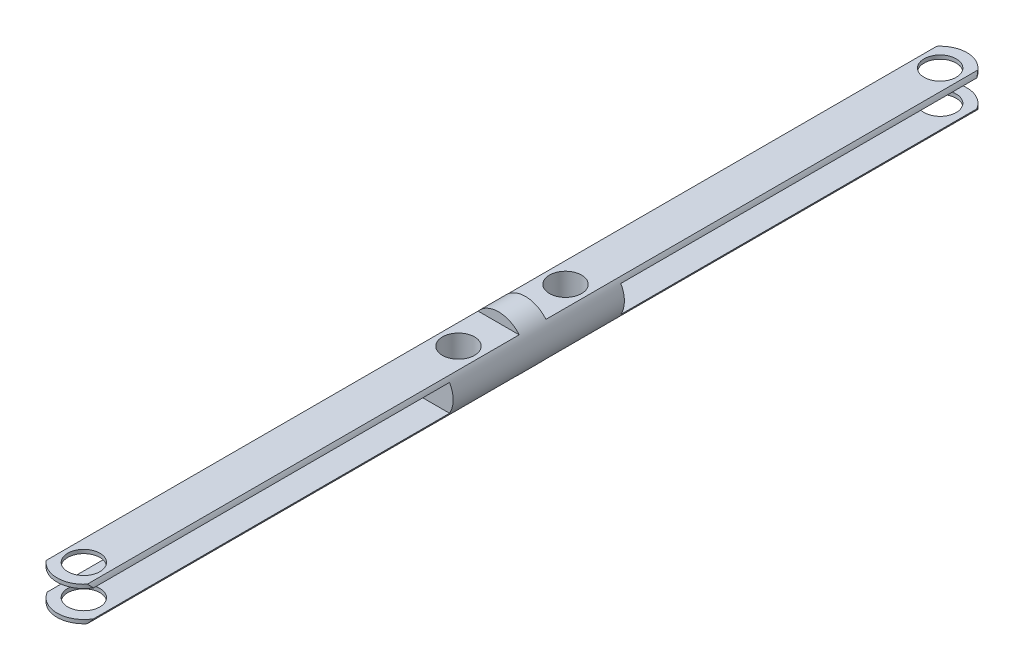
ISO-10303-21;
HEADER;
FILE_DESCRIPTION(('STEP AP214'),'2;1');
FILE_NAME('part.step','',(''),(''),'','','');
FILE_SCHEMA(('AUTOMOTIVE_DESIGN { 1 0 10303 214 1 1 1 1 }'));
ENDSEC;
DATA;
#1=APPLICATION_CONTEXT('core data for automotive mechanical design processes');
#2=APPLICATION_PROTOCOL_DEFINITION('international standard','automotive_design',2000,#1);
#3=PRODUCT_CONTEXT('',#1,'mechanical');
#4=PRODUCT('Part','Part','',(#3));
#5=PRODUCT_RELATED_PRODUCT_CATEGORY('part','',(#4));
#6=PRODUCT_DEFINITION_FORMATION('','',#4);
#7=PRODUCT_DEFINITION_CONTEXT('part definition',#1,'design');
#8=PRODUCT_DEFINITION('design','',#6,#7);
#9=PRODUCT_DEFINITION_SHAPE('','',#8);
#10=(LENGTH_UNIT() NAMED_UNIT(*) SI_UNIT(.MILLI.,.METRE.));
#11=(NAMED_UNIT(*) PLANE_ANGLE_UNIT() SI_UNIT($,.RADIAN.));
#12=(NAMED_UNIT(*) SI_UNIT($,.STERADIAN.) SOLID_ANGLE_UNIT());
#13=UNCERTAINTY_MEASURE_WITH_UNIT(LENGTH_MEASURE(1.E-05),#10,'distance_accuracy_value','');
#14=(GEOMETRIC_REPRESENTATION_CONTEXT(3) GLOBAL_UNCERTAINTY_ASSIGNED_CONTEXT((#13)) GLOBAL_UNIT_ASSIGNED_CONTEXT((#10,
#11,#12)) REPRESENTATION_CONTEXT('',''));
#15=CARTESIAN_POINT('',(0.,0.,0.));
#16=DIRECTION('',(0.,0.,1.));
#17=DIRECTION('',(1.,0.,0.));
#18=AXIS2_PLACEMENT_3D('',#15,#16,#17);
#19=CARTESIAN_POINT('',(0.,1.6,100.));
#20=DIRECTION('',(0.,1.,0.));
#21=DIRECTION('',(-1.,0.,0.));
#22=AXIS2_PLACEMENT_3D('',#19,#20,#21);
#23=PLANE('',#22);
#24=CARTESIAN_POINT('',(0.,1.6,10.));
#25=DIRECTION('',(0.,1.,0.));
#26=DIRECTION('',(-1.,0.,0.));
#27=AXIS2_PLACEMENT_3D('',#24,#25,#26);
#28=CIRCLE('',#27,1.5);
#29=CARTESIAN_POINT('',(-1.50000000000001,1.6,10.));
#30=VERTEX_POINT('',#29);
#31=EDGE_CURVE('E289',#30,#30,#28,.F.);
#32=ORIENTED_EDGE('',*,*,#31,.T.);
#33=EDGE_LOOP('',(#32));
#34=FACE_BOUND('',#33,.T.);
#35=CARTESIAN_POINT('',(0.,1.6,45.));
#36=DIRECTION('',(0.,1.,0.));
#37=DIRECTION('',(-1.,0.,0.));
#38=AXIS2_PLACEMENT_3D('',#35,#36,#37);
#39=CIRCLE('',#38,1.5);
#40=CARTESIAN_POINT('',(-1.5,1.6,45.));
#41=VERTEX_POINT('',#40);
#42=EDGE_CURVE('E293',#41,#41,#39,.F.);
#43=ORIENTED_EDGE('',*,*,#42,.T.);
#44=EDGE_LOOP('',(#43));
#45=FACE_BOUND('',#44,.T.);
#46=DIRECTION('',(0.,0.,-1.));
#47=VECTOR('',#46,1.);
#48=CARTESIAN_POINT('',(-1.92093727122985,1.6,100.));
#49=LINE('',#48,#47);
#50=CARTESIAN_POINT('',(-1.92093727122985,1.6,48.75));
#51=VERTEX_POINT('',#50);
#52=CARTESIAN_POINT('',(-1.92093727122985,1.6,8.4));
#53=VERTEX_POINT('',#52);
#54=EDGE_CURVE('E130',#51,#53,#49,.T.);
#55=ORIENTED_EDGE('',*,*,#54,.F.);
#56=DIRECTION('',(1.,0.,0.));
#57=VECTOR('',#56,1.);
#58=CARTESIAN_POINT('',(0.,1.6,48.75));
#59=LINE('',#58,#57);
#60=CARTESIAN_POINT('',(1.92093727122985,1.6,48.75));
#61=VERTEX_POINT('',#60);
#62=EDGE_CURVE('E125',#51,#61,#59,.T.);
#63=ORIENTED_EDGE('',*,*,#62,.T.);
#64=DIRECTION('',(0.,0.,-1.));
#65=VECTOR('',#64,1.);
#66=CARTESIAN_POINT('',(1.92093727122985,1.6,100.));
#67=LINE('',#66,#65);
#68=CARTESIAN_POINT('',(1.92093727122985,1.6,8.4));
#69=VERTEX_POINT('',#68);
#70=EDGE_CURVE('E296',#61,#69,#67,.T.);
#71=ORIENTED_EDGE('',*,*,#70,.T.);
#72=CARTESIAN_POINT('',(0.,1.6,10.));
#73=DIRECTION('',(0.,1.,0.));
#74=DIRECTION('',(-1.,0.,0.));
#75=AXIS2_PLACEMENT_3D('',#72,#73,#74);
#76=CIRCLE('',#75,2.5);
#77=EDGE_CURVE('E285',#53,#69,#76,.F.);
#78=ORIENTED_EDGE('',*,*,#77,.F.);
#79=EDGE_LOOP('',(#55,#63,#71,#78));
#80=FACE_BOUND('',#79,.T.);
#81=ADVANCED_FACE('F111',(#34,#45,#80),#23,.T.);
#82=CARTESIAN_POINT('',(0.,-1.6,100.));
#83=DIRECTION('',(0.,1.,0.));
#84=DIRECTION('',(-1.,0.,0.));
#85=AXIS2_PLACEMENT_3D('',#82,#83,#84);
#86=PLANE('',#85);
#87=CARTESIAN_POINT('',(0.,-1.6,10.));
#88=DIRECTION('',(0.,1.,0.));
#89=DIRECTION('',(-1.,0.,0.));
#90=AXIS2_PLACEMENT_3D('',#87,#88,#89);
#91=CIRCLE('',#90,1.5);
#92=CARTESIAN_POINT('',(-1.50000000000001,-1.6,10.));
#93=VERTEX_POINT('',#92);
#94=EDGE_CURVE('E288',#93,#93,#91,.F.);
#95=ORIENTED_EDGE('',*,*,#94,.F.);
#96=EDGE_LOOP('',(#95));
#97=FACE_BOUND('',#96,.T.);
#98=CARTESIAN_POINT('',(0.,-1.6,45.));
#99=DIRECTION('',(0.,1.,0.));
#100=DIRECTION('',(-1.,0.,0.));
#101=AXIS2_PLACEMENT_3D('',#98,#99,#100);
#102=CIRCLE('',#101,1.5);
#103=CARTESIAN_POINT('',(-1.5,-1.6,45.));
#104=VERTEX_POINT('',#103);
#105=EDGE_CURVE('E292',#104,#104,#102,.F.);
#106=ORIENTED_EDGE('',*,*,#105,.F.);
#107=EDGE_LOOP('',(#106));
#108=FACE_BOUND('',#107,.T.);
#109=DIRECTION('',(1.,0.,0.));
#110=VECTOR('',#109,1.);
#111=CARTESIAN_POINT('',(0.,-1.6,48.75));
#112=LINE('',#111,#110);
#113=CARTESIAN_POINT('',(-1.92093727122985,-1.6,48.75));
#114=VERTEX_POINT('',#113);
#115=CARTESIAN_POINT('',(1.92093727122986,-1.6,48.75));
#116=VERTEX_POINT('',#115);
#117=EDGE_CURVE('E14',#114,#116,#112,.T.);
#118=ORIENTED_EDGE('',*,*,#117,.F.);
#119=DIRECTION('',(0.,0.,-1.));
#120=VECTOR('',#119,1.);
#121=CARTESIAN_POINT('',(-1.92093727122985,-1.6,100.));
#122=LINE('',#121,#120);
#123=CARTESIAN_POINT('',(-1.92093727122985,-1.6,8.39999999999999));
#124=VERTEX_POINT('',#123);
#125=EDGE_CURVE('E300',#114,#124,#122,.T.);
#126=ORIENTED_EDGE('',*,*,#125,.T.);
#127=CARTESIAN_POINT('',(0.,-1.6,10.));
#128=DIRECTION('',(0.,1.,0.));
#129=DIRECTION('',(-1.,0.,0.));
#130=AXIS2_PLACEMENT_3D('',#127,#128,#129);
#131=CIRCLE('',#130,2.5);
#132=CARTESIAN_POINT('',(1.92093727122986,-1.6,8.4));
#133=VERTEX_POINT('',#132);
#134=EDGE_CURVE('E276',#124,#133,#131,.F.);
#135=ORIENTED_EDGE('',*,*,#134,.T.);
#136=DIRECTION('',(0.,0.,-1.));
#137=VECTOR('',#136,1.);
#138=CARTESIAN_POINT('',(1.92093727122986,-1.6,100.));
#139=LINE('',#138,#137);
#140=EDGE_CURVE('E298',#116,#133,#139,.T.);
#141=ORIENTED_EDGE('',*,*,#140,.F.);
#142=EDGE_LOOP('',(#118,#126,#135,#141));
#143=FACE_BOUND('',#142,.T.);
#144=ADVANCED_FACE('F337',(#97,#108,#143),#86,.F.);
#145=CARTESIAN_POINT('',(0.,0.,100.));
#146=DIRECTION('',(0.,0.,-1.));
#147=DIRECTION('',(-1.,0.,0.));
#148=AXIS2_PLACEMENT_3D('',#145,#146,#147);
#149=CYLINDRICAL_SURFACE('',#148,2.5);
#150=CARTESIAN_POINT('',(0.,0.,48.75));
#151=DIRECTION('',(0.,0.,1.));
#152=DIRECTION('',(1.,0.,0.));
#153=AXIS2_PLACEMENT_3D('',#150,#151,#152);
#154=CIRCLE('',#153,2.5);
#155=EDGE_CURVE('E245',#61,#51,#154,.T.);
#156=ORIENTED_EDGE('',*,*,#155,.T.);
#157=ORIENTED_EDGE('',*,*,#54,.T.);
#158=CARTESIAN_POINT('',(0.,0.,10.));
#159=DIRECTION('',(0.,-0.707106781186547,-0.707106781186547));
#160=DIRECTION('',(0.,0.707106781186547,-0.707106781186547));
#161=AXIS2_PLACEMENT_3D('',#158,#159,#160);
#162=ELLIPSE('',#161,3.53553390593274,2.5);
#163=CARTESIAN_POINT('',(-2.16506350946111,1.25,8.75000000000001));
#164=VERTEX_POINT('',#163);
#165=EDGE_CURVE('E282',#53,#164,#162,.F.);
#166=ORIENTED_EDGE('',*,*,#165,.T.);
#167=DIRECTION('',(0.,0.,-1.));
#168=VECTOR('',#167,1.);
#169=CARTESIAN_POINT('',(-2.1650635094611,1.24999999999999,100.));
#170=LINE('',#169,#168);
#171=CARTESIAN_POINT('',(-2.1650635094611,1.25,42.));
#172=VERTEX_POINT('',#171);
#173=EDGE_CURVE('E272',#172,#164,#170,.T.);
#174=ORIENTED_EDGE('',*,*,#173,.F.);
#175=CARTESIAN_POINT('',(0.,0.,42.));
#176=DIRECTION('',(0.,0.,-1.));
#177=DIRECTION('',(0.,1.,0.));
#178=AXIS2_PLACEMENT_3D('',#175,#176,#177);
#179=CIRCLE('',#178,2.5);
#180=CARTESIAN_POINT('',(-2.16506350946109,-1.25,42.));
#181=VERTEX_POINT('',#180);
#182=EDGE_CURVE('E274',#181,#172,#179,.T.);
#183=ORIENTED_EDGE('',*,*,#182,.F.);
#184=DIRECTION('',(0.,0.,-1.));
#185=VECTOR('',#184,1.);
#186=CARTESIAN_POINT('',(-2.16506350946109,-1.25000000000001,100.));
#187=LINE('',#186,#185);
#188=CARTESIAN_POINT('',(-2.16506350946111,-1.25,8.75000000000001));
#189=VERTEX_POINT('',#188);
#190=EDGE_CURVE('E265',#189,#181,#187,.F.);
#191=ORIENTED_EDGE('',*,*,#190,.F.);
#192=CARTESIAN_POINT('',(0.,0.,10.));
#193=DIRECTION('',(0.,0.707106781186547,-0.707106781186547));
#194=DIRECTION('',(0.,-0.707106781186547,-0.707106781186547));
#195=AXIS2_PLACEMENT_3D('',#192,#193,#194);
#196=ELLIPSE('',#195,3.53553390593274,2.5);
#197=EDGE_CURVE('E279',#189,#124,#196,.F.);
#198=ORIENTED_EDGE('',*,*,#197,.T.);
#199=ORIENTED_EDGE('',*,*,#125,.F.);
#200=EDGE_CURVE('E241',#114,#116,#154,.T.);
#201=ORIENTED_EDGE('',*,*,#200,.T.);
#202=ORIENTED_EDGE('',*,*,#140,.T.);
#203=CARTESIAN_POINT('',(0.,0.,10.));
#204=DIRECTION('',(0.,0.707106781186547,-0.707106781186547));
#205=DIRECTION('',(0.,-0.707106781186547,-0.707106781186547));
#206=AXIS2_PLACEMENT_3D('',#203,#204,#205);
#207=ELLIPSE('',#206,3.53553390593274,2.5);
#208=CARTESIAN_POINT('',(2.16506350946109,-1.25,8.75000000000001));
#209=VERTEX_POINT('',#208);
#210=EDGE_CURVE('E303',#133,#209,#207,.F.);
#211=ORIENTED_EDGE('',*,*,#210,.T.);
#212=DIRECTION('',(0.,0.,-1.));
#213=VECTOR('',#212,1.);
#214=CARTESIAN_POINT('',(2.16506350946109,-1.25000000000001,100.));
#215=LINE('',#214,#213);
#216=CARTESIAN_POINT('',(2.16506350946109,-1.25,42.));
#217=VERTEX_POINT('',#216);
#218=EDGE_CURVE('E263',#217,#209,#215,.T.);
#219=ORIENTED_EDGE('',*,*,#218,.F.);
#220=CARTESIAN_POINT('',(0.,0.,42.));
#221=DIRECTION('',(0.,0.,-1.));
#222=DIRECTION('',(0.,1.,0.));
#223=AXIS2_PLACEMENT_3D('',#220,#221,#222);
#224=CIRCLE('',#223,2.5);
#225=CARTESIAN_POINT('',(2.1650635094611,1.25,42.));
#226=VERTEX_POINT('',#225);
#227=EDGE_CURVE('E118',#226,#217,#224,.T.);
#228=ORIENTED_EDGE('',*,*,#227,.F.);
#229=DIRECTION('',(0.,0.,-1.));
#230=VECTOR('',#229,1.);
#231=CARTESIAN_POINT('',(2.1650635094611,1.24999999999999,100.));
#232=LINE('',#231,#230);
#233=CARTESIAN_POINT('',(2.1650635094611,1.25,8.75000000000001));
#234=VERTEX_POINT('',#233);
#235=EDGE_CURVE('E270',#234,#226,#232,.F.);
#236=ORIENTED_EDGE('',*,*,#235,.F.);
#237=CARTESIAN_POINT('',(0.,0.,10.));
#238=DIRECTION('',(0.,-0.707106781186547,-0.707106781186547));
#239=DIRECTION('',(0.,0.707106781186547,-0.707106781186547));
#240=AXIS2_PLACEMENT_3D('',#237,#238,#239);
#241=ELLIPSE('',#240,3.53553390593274,2.5);
#242=EDGE_CURVE('E306',#234,#69,#241,.F.);
#243=ORIENTED_EDGE('',*,*,#242,.T.);
#244=ORIENTED_EDGE('',*,*,#70,.F.);
#245=EDGE_LOOP('',(#156,#157,#166,#174,#183,#191,#198,#199,#201,#202,#211,#219,#228,#236,#243,#244));
#246=FACE_BOUND('',#245,.T.);
#247=CARTESIAN_POINT('',(0.,0.,51.25));
#248=DIRECTION('',(0.,0.,1.));
#249=DIRECTION('',(1.,0.,0.));
#250=AXIS2_PLACEMENT_3D('',#247,#248,#249);
#251=CIRCLE('',#250,2.5);
#252=CARTESIAN_POINT('',(1.92093727122985,1.6,51.25));
#253=VERTEX_POINT('',#252);
#254=CARTESIAN_POINT('',(-1.92093727122985,1.6,51.25));
#255=VERTEX_POINT('',#254);
#256=EDGE_CURVE('E231',#253,#255,#251,.T.);
#257=ORIENTED_EDGE('',*,*,#256,.F.);
#258=DIRECTION('',(0.,0.,1.));
#259=VECTOR('',#258,1.);
#260=CARTESIAN_POINT('',(1.92093727122985,1.6,0.));
#261=LINE('',#260,#259);
#262=CARTESIAN_POINT('',(1.92093727122985,1.6,91.6));
#263=VERTEX_POINT('',#262);
#264=EDGE_CURVE('E567',#253,#263,#261,.T.);
#265=ORIENTED_EDGE('',*,*,#264,.T.);
#266=CARTESIAN_POINT('',(0.,0.,90.));
#267=DIRECTION('',(0.,0.707106781186547,-0.707106781186547));
#268=DIRECTION('',(0.,0.707106781186547,0.707106781186547));
#269=AXIS2_PLACEMENT_3D('',#266,#267,#268);
#270=ELLIPSE('',#269,3.53553390593274,2.5);
#271=CARTESIAN_POINT('',(2.1650635094611,1.25,91.25));
#272=VERTEX_POINT('',#271);
#273=EDGE_CURVE('E248',#272,#263,#270,.F.);
#274=ORIENTED_EDGE('',*,*,#273,.F.);
#275=DIRECTION('',(0.,0.,1.));
#276=VECTOR('',#275,1.);
#277=CARTESIAN_POINT('',(2.1650635094611,1.24999999999999,0.));
#278=LINE('',#277,#276);
#279=CARTESIAN_POINT('',(2.1650635094611,1.25,58.));
#280=VERTEX_POINT('',#279);
#281=EDGE_CURVE('E599',#272,#280,#278,.F.);
#282=ORIENTED_EDGE('',*,*,#281,.T.);
#283=CARTESIAN_POINT('',(0.,0.,58.));
#284=DIRECTION('',(0.,0.,-1.));
#285=DIRECTION('',(0.,1.,0.));
#286=AXIS2_PLACEMENT_3D('',#283,#284,#285);
#287=CIRCLE('',#286,2.5);
#288=CARTESIAN_POINT('',(2.16506350946109,-1.25,58.));
#289=VERTEX_POINT('',#288);
#290=EDGE_CURVE('E242',#280,#289,#287,.T.);
#291=ORIENTED_EDGE('',*,*,#290,.T.);
#292=DIRECTION('',(0.,0.,1.));
#293=VECTOR('',#292,1.);
#294=CARTESIAN_POINT('',(2.16506350946109,-1.25000000000001,0.));
#295=LINE('',#294,#293);
#296=CARTESIAN_POINT('',(2.16506350946109,-1.25,91.25));
#297=VERTEX_POINT('',#296);
#298=EDGE_CURVE('E602',#289,#297,#295,.T.);
#299=ORIENTED_EDGE('',*,*,#298,.T.);
#300=CARTESIAN_POINT('',(0.,0.,90.));
#301=DIRECTION('',(0.,-0.707106781186547,-0.707106781186547));
#302=DIRECTION('',(0.,-0.707106781186547,0.707106781186547));
#303=AXIS2_PLACEMENT_3D('',#300,#301,#302);
#304=ELLIPSE('',#303,3.53553390593274,2.5);
#305=CARTESIAN_POINT('',(1.92093727122986,-1.6,91.6));
#306=VERTEX_POINT('',#305);
#307=EDGE_CURVE('E580',#306,#297,#304,.F.);
#308=ORIENTED_EDGE('',*,*,#307,.F.);
#309=DIRECTION('',(0.,0.,1.));
#310=VECTOR('',#309,1.);
#311=CARTESIAN_POINT('',(1.92093727122986,-1.6,0.));
#312=LINE('',#311,#310);
#313=CARTESIAN_POINT('',(1.92093727122986,-1.6,51.25));
#314=VERTEX_POINT('',#313);
#315=EDGE_CURVE('E227',#314,#306,#312,.T.);
#316=ORIENTED_EDGE('',*,*,#315,.F.);
#317=CARTESIAN_POINT('',(-1.92093727122985,-1.6,51.25));
#318=VERTEX_POINT('',#317);
#319=EDGE_CURVE('E220',#318,#314,#251,.T.);
#320=ORIENTED_EDGE('',*,*,#319,.F.);
#321=DIRECTION('',(0.,0.,1.));
#322=VECTOR('',#321,1.);
#323=CARTESIAN_POINT('',(-1.92093727122985,-1.6,0.));
#324=LINE('',#323,#322);
#325=CARTESIAN_POINT('',(-1.92093727122985,-1.6,91.6));
#326=VERTEX_POINT('',#325);
#327=EDGE_CURVE('E224',#318,#326,#324,.T.);
#328=ORIENTED_EDGE('',*,*,#327,.T.);
#329=CARTESIAN_POINT('',(0.,0.,90.));
#330=DIRECTION('',(0.,-0.707106781186547,-0.707106781186547));
#331=DIRECTION('',(0.,-0.707106781186547,0.707106781186547));
#332=AXIS2_PLACEMENT_3D('',#329,#330,#331);
#333=ELLIPSE('',#332,3.53553390593274,2.5);
#334=CARTESIAN_POINT('',(-2.16506350946111,-1.25,91.25));
#335=VERTEX_POINT('',#334);
#336=EDGE_CURVE('E618',#335,#326,#333,.F.);
#337=ORIENTED_EDGE('',*,*,#336,.F.);
#338=DIRECTION('',(0.,0.,1.));
#339=VECTOR('',#338,1.);
#340=CARTESIAN_POINT('',(-2.16506350946109,-1.25000000000001,0.));
#341=LINE('',#340,#339);
#342=CARTESIAN_POINT('',(-2.16506350946109,-1.25,58.));
#343=VERTEX_POINT('',#342);
#344=EDGE_CURVE('E597',#335,#343,#341,.F.);
#345=ORIENTED_EDGE('',*,*,#344,.T.);
#346=CARTESIAN_POINT('',(0.,0.,58.));
#347=DIRECTION('',(0.,0.,-1.));
#348=DIRECTION('',(0.,1.,0.));
#349=AXIS2_PLACEMENT_3D('',#346,#347,#348);
#350=CIRCLE('',#349,2.5);
#351=CARTESIAN_POINT('',(-2.1650635094611,1.25,58.));
#352=VERTEX_POINT('',#351);
#353=EDGE_CURVE('E615',#343,#352,#350,.T.);
#354=ORIENTED_EDGE('',*,*,#353,.T.);
#355=DIRECTION('',(0.,0.,1.));
#356=VECTOR('',#355,1.);
#357=CARTESIAN_POINT('',(-2.1650635094611,1.24999999999999,0.));
#358=LINE('',#357,#356);
#359=CARTESIAN_POINT('',(-2.16506350946111,1.25,91.25));
#360=VERTEX_POINT('',#359);
#361=EDGE_CURVE('E612',#352,#360,#358,.T.);
#362=ORIENTED_EDGE('',*,*,#361,.T.);
#363=CARTESIAN_POINT('',(0.,0.,90.));
#364=DIRECTION('',(0.,0.707106781186547,-0.707106781186547));
#365=DIRECTION('',(0.,0.707106781186547,0.707106781186547));
#366=AXIS2_PLACEMENT_3D('',#363,#364,#365);
#367=ELLIPSE('',#366,3.53553390593274,2.5);
#368=CARTESIAN_POINT('',(-1.92093727122985,1.6,91.6));
#369=VERTEX_POINT('',#368);
#370=EDGE_CURVE('E620',#369,#360,#367,.F.);
#371=ORIENTED_EDGE('',*,*,#370,.F.);
#372=DIRECTION('',(0.,0.,1.));
#373=VECTOR('',#372,1.);
#374=CARTESIAN_POINT('',(-1.92093727122985,1.6,0.));
#375=LINE('',#374,#373);
#376=EDGE_CURVE('E238',#255,#369,#375,.T.);
#377=ORIENTED_EDGE('',*,*,#376,.F.);
#378=EDGE_LOOP('',(#257,#265,#274,#282,#291,#299,#308,#316,#320,#328,#337,#345,#354,#362,#371,#377));
#379=FACE_BOUND('',#378,.T.);
#380=ADVANCED_FACE('F222',(#246,#379),#149,.T.);
#381=CARTESIAN_POINT('',(0.,22.,10.));
#382=DIRECTION('',(0.,-1.,0.));
#383=DIRECTION('',(0.,0.,-1.));
#384=AXIS2_PLACEMENT_3D('',#381,#382,#383);
#385=CYLINDRICAL_SURFACE('',#384,2.5);
#386=CARTESIAN_POINT('',(0.,1.25,10.));
#387=DIRECTION('',(0.,-1.,0.));
#388=DIRECTION('',(0.,0.,-1.));
#389=AXIS2_PLACEMENT_3D('',#386,#387,#388);
#390=CIRCLE('',#389,2.5);
#391=EDGE_CURVE('E268',#164,#234,#390,.T.);
#392=ORIENTED_EDGE('',*,*,#391,.F.);
#393=ORIENTED_EDGE('',*,*,#165,.F.);
#394=ORIENTED_EDGE('',*,*,#77,.T.);
#395=ORIENTED_EDGE('',*,*,#242,.F.);
#396=EDGE_LOOP('',(#392,#393,#394,#395));
#397=FACE_BOUND('',#396,.T.);
#398=ADVANCED_FACE('F345',(#397),#385,.T.);
#399=CARTESIAN_POINT('',(0.,-1.25,10.));
#400=DIRECTION('',(0.,1.,0.));
#401=DIRECTION('',(0.,0.,1.));
#402=AXIS2_PLACEMENT_3D('',#399,#400,#401);
#403=CIRCLE('',#402,2.5);
#404=EDGE_CURVE('E261',#209,#189,#403,.T.);
#405=ORIENTED_EDGE('',*,*,#404,.F.);
#406=ORIENTED_EDGE('',*,*,#210,.F.);
#407=ORIENTED_EDGE('',*,*,#134,.F.);
#408=ORIENTED_EDGE('',*,*,#197,.F.);
#409=EDGE_LOOP('',(#405,#406,#407,#408));
#410=FACE_BOUND('',#409,.T.);
#411=ADVANCED_FACE('F333',(#410),#385,.T.);
#412=CARTESIAN_POINT('',(0.,22.,10.));
#413=DIRECTION('',(0.,-1.,0.));
#414=DIRECTION('',(0.,0.,-1.));
#415=AXIS2_PLACEMENT_3D('',#412,#413,#414);
#416=CYLINDRICAL_SURFACE('',#415,1.5);
#417=ORIENTED_EDGE('',*,*,#31,.F.);
#418=EDGE_LOOP('',(#417));
#419=FACE_BOUND('',#418,.T.);
#420=CARTESIAN_POINT('',(0.,1.25,10.));
#421=DIRECTION('',(0.,-1.,0.));
#422=DIRECTION('',(0.,0.,-1.));
#423=AXIS2_PLACEMENT_3D('',#420,#421,#422);
#424=CIRCLE('',#423,1.5);
#425=CARTESIAN_POINT('',(0.,1.25,8.50000000000001));
#426=VERTEX_POINT('',#425);
#427=EDGE_CURVE('E267',#426,#426,#424,.T.);
#428=ORIENTED_EDGE('',*,*,#427,.T.);
#429=EDGE_LOOP('',(#428));
#430=FACE_BOUND('',#429,.T.);
#431=ADVANCED_FACE('F384',(#419,#430),#416,.F.);
#432=ORIENTED_EDGE('',*,*,#94,.T.);
#433=EDGE_LOOP('',(#432));
#434=FACE_BOUND('',#433,.T.);
#435=CARTESIAN_POINT('',(0.,-1.25,10.));
#436=DIRECTION('',(0.,1.,0.));
#437=DIRECTION('',(0.,0.,1.));
#438=AXIS2_PLACEMENT_3D('',#435,#436,#437);
#439=CIRCLE('',#438,1.5);
#440=CARTESIAN_POINT('',(0.,-1.25,11.5));
#441=VERTEX_POINT('',#440);
#442=EDGE_CURVE('E260',#441,#441,#439,.T.);
#443=ORIENTED_EDGE('',*,*,#442,.T.);
#444=EDGE_LOOP('',(#443));
#445=FACE_BOUND('',#444,.T.);
#446=ADVANCED_FACE('F375',(#434,#445),#416,.F.);
#447=CARTESIAN_POINT('',(0.,22.,45.));
#448=DIRECTION('',(0.,-1.,0.));
#449=DIRECTION('',(0.,0.,-1.));
#450=AXIS2_PLACEMENT_3D('',#447,#448,#449);
#451=CYLINDRICAL_SURFACE('',#450,1.5);
#452=ORIENTED_EDGE('',*,*,#42,.F.);
#453=EDGE_LOOP('',(#452));
#454=FACE_BOUND('',#453,.T.);
#455=ORIENTED_EDGE('',*,*,#105,.T.);
#456=EDGE_LOOP('',(#455));
#457=FACE_BOUND('',#456,.T.);
#458=ADVANCED_FACE('F372',(#454,#457),#451,.F.);
#459=CARTESIAN_POINT('',(22.,1.25,42.));
#460=DIRECTION('',(0.,0.,-1.));
#461=DIRECTION('',(0.,1.,0.));
#462=AXIS2_PLACEMENT_3D('',#459,#460,#461);
#463=PLANE('',#462);
#464=ORIENTED_EDGE('',*,*,#182,.T.);
#465=DIRECTION('',(-1.,0.,0.));
#466=VECTOR('',#465,1.);
#467=CARTESIAN_POINT('',(22.,1.25,42.));
#468=LINE('',#467,#466);
#469=EDGE_CURVE('E257',#226,#172,#468,.T.);
#470=ORIENTED_EDGE('',*,*,#469,.F.);
#471=ORIENTED_EDGE('',*,*,#227,.T.);
#472=DIRECTION('',(-1.,0.,0.));
#473=VECTOR('',#472,1.);
#474=CARTESIAN_POINT('',(22.,-1.25,42.));
#475=LINE('',#474,#473);
#476=EDGE_CURVE('E254',#217,#181,#475,.T.);
#477=ORIENTED_EDGE('',*,*,#476,.T.);
#478=EDGE_LOOP('',(#464,#470,#471,#477));
#479=FACE_BOUND('',#478,.T.);
#480=ADVANCED_FACE('F320',(#479),#463,.T.);
#481=CARTESIAN_POINT('',(22.,1.25,-22.));
#482=DIRECTION('',(0.,-1.,0.));
#483=DIRECTION('',(0.,0.,-1.));
#484=AXIS2_PLACEMENT_3D('',#481,#482,#483);
#485=PLANE('',#484);
#486=ORIENTED_EDGE('',*,*,#427,.F.);
#487=EDGE_LOOP('',(#486));
#488=FACE_BOUND('',#487,.T.);
#489=ORIENTED_EDGE('',*,*,#173,.T.);
#490=ORIENTED_EDGE('',*,*,#391,.T.);
#491=ORIENTED_EDGE('',*,*,#235,.T.);
#492=ORIENTED_EDGE('',*,*,#469,.T.);
#493=EDGE_LOOP('',(#489,#490,#491,#492));
#494=FACE_BOUND('',#493,.T.);
#495=ADVANCED_FACE('F341',(#488,#494),#485,.T.);
#496=CARTESIAN_POINT('',(22.,-1.25,-22.));
#497=DIRECTION('',(0.,1.,0.));
#498=DIRECTION('',(0.,0.,1.));
#499=AXIS2_PLACEMENT_3D('',#496,#497,#498);
#500=PLANE('',#499);
#501=ORIENTED_EDGE('',*,*,#442,.F.);
#502=EDGE_LOOP('',(#501));
#503=FACE_BOUND('',#502,.T.);
#504=ORIENTED_EDGE('',*,*,#190,.T.);
#505=ORIENTED_EDGE('',*,*,#476,.F.);
#506=ORIENTED_EDGE('',*,*,#218,.T.);
#507=ORIENTED_EDGE('',*,*,#404,.T.);
#508=EDGE_LOOP('',(#504,#505,#506,#507));
#509=FACE_BOUND('',#508,.T.);
#510=ADVANCED_FACE('F326',(#503,#509),#500,.T.);
#511=CARTESIAN_POINT('',(0.,0.,48.75));
#512=DIRECTION('',(0.,0.,1.));
#513=DIRECTION('',(1.,0.,0.));
#514=AXIS2_PLACEMENT_3D('',#511,#512,#513);
#515=PLANE('',#514);
#516=ORIENTED_EDGE('',*,*,#200,.F.);
#517=ORIENTED_EDGE('',*,*,#117,.T.);
#518=EDGE_LOOP('',(#516,#517));
#519=FACE_BOUND('',#518,.T.);
#520=ADVANCED_FACE('F352',(#519),#515,.F.);
#521=ORIENTED_EDGE('',*,*,#62,.F.);
#522=ORIENTED_EDGE('',*,*,#155,.F.);
#523=EDGE_LOOP('',(#521,#522));
#524=FACE_BOUND('',#523,.T.);
#525=ADVANCED_FACE('F349',(#524),#515,.F.);
#526=CARTESIAN_POINT('',(0.,1.6,0.));
#527=DIRECTION('',(0.,1.,0.));
#528=DIRECTION('',(-1.,0.,0.));
#529=AXIS2_PLACEMENT_3D('',#526,#527,#528);
#530=PLANE('',#529);
#531=CARTESIAN_POINT('',(0.,1.6,90.));
#532=DIRECTION('',(0.,-1.,0.));
#533=DIRECTION('',(-1.,0.,0.));
#534=AXIS2_PLACEMENT_3D('',#531,#532,#533);
#535=CIRCLE('',#534,1.5);
#536=CARTESIAN_POINT('',(-1.50000000000001,1.6,90.));
#537=VERTEX_POINT('',#536);
#538=EDGE_CURVE('E587',#537,#537,#535,.F.);
#539=ORIENTED_EDGE('',*,*,#538,.F.);
#540=EDGE_LOOP('',(#539));
#541=FACE_BOUND('',#540,.T.);
#542=CARTESIAN_POINT('',(0.,1.6,55.));
#543=DIRECTION('',(0.,-1.,0.));
#544=DIRECTION('',(-1.,0.,0.));
#545=AXIS2_PLACEMENT_3D('',#542,#543,#544);
#546=CIRCLE('',#545,1.5);
#547=CARTESIAN_POINT('',(-1.5,1.6,55.));
#548=VERTEX_POINT('',#547);
#549=EDGE_CURVE('E571',#548,#548,#546,.F.);
#550=ORIENTED_EDGE('',*,*,#549,.F.);
#551=EDGE_LOOP('',(#550));
#552=FACE_BOUND('',#551,.T.);
#553=ORIENTED_EDGE('',*,*,#376,.T.);
#554=CARTESIAN_POINT('',(0.,1.6,90.));
#555=DIRECTION('',(0.,-1.,0.));
#556=DIRECTION('',(-1.,0.,0.));
#557=AXIS2_PLACEMENT_3D('',#554,#555,#556);
#558=CIRCLE('',#557,2.5);
#559=EDGE_CURVE('E569',#369,#263,#558,.F.);
#560=ORIENTED_EDGE('',*,*,#559,.T.);
#561=ORIENTED_EDGE('',*,*,#264,.F.);
#562=DIRECTION('',(1.,0.,0.));
#563=VECTOR('',#562,1.);
#564=CARTESIAN_POINT('',(0.,1.6,51.25));
#565=LINE('',#564,#563);
#566=EDGE_CURVE('E558',#255,#253,#565,.T.);
#567=ORIENTED_EDGE('',*,*,#566,.F.);
#568=EDGE_LOOP('',(#553,#560,#561,#567));
#569=FACE_BOUND('',#568,.T.);
#570=ADVANCED_FACE('F351',(#541,#552,#569),#530,.T.);
#571=CARTESIAN_POINT('',(0.,-1.6,0.));
#572=DIRECTION('',(0.,1.,0.));
#573=DIRECTION('',(-1.,0.,0.));
#574=AXIS2_PLACEMENT_3D('',#571,#572,#573);
#575=PLANE('',#574);
#576=CARTESIAN_POINT('',(0.,-1.6,90.));
#577=DIRECTION('',(0.,-1.,0.));
#578=DIRECTION('',(-1.,0.,0.));
#579=AXIS2_PLACEMENT_3D('',#576,#577,#578);
#580=CIRCLE('',#579,1.5);
#581=CARTESIAN_POINT('',(-1.50000000000001,-1.6,90.));
#582=VERTEX_POINT('',#581);
#583=EDGE_CURVE('E584',#582,#582,#580,.F.);
#584=ORIENTED_EDGE('',*,*,#583,.T.);
#585=EDGE_LOOP('',(#584));
#586=FACE_BOUND('',#585,.T.);
#587=CARTESIAN_POINT('',(0.,-1.6,55.));
#588=DIRECTION('',(0.,-1.,0.));
#589=DIRECTION('',(-1.,0.,0.));
#590=AXIS2_PLACEMENT_3D('',#587,#588,#589);
#591=CIRCLE('',#590,1.5);
#592=CARTESIAN_POINT('',(-1.5,-1.6,55.));
#593=VERTEX_POINT('',#592);
#594=EDGE_CURVE('E575',#593,#593,#591,.F.);
#595=ORIENTED_EDGE('',*,*,#594,.T.);
#596=EDGE_LOOP('',(#595));
#597=FACE_BOUND('',#596,.T.);
#598=DIRECTION('',(1.,0.,0.));
#599=VECTOR('',#598,1.);
#600=CARTESIAN_POINT('',(0.,-1.6,51.25));
#601=LINE('',#600,#599);
#602=EDGE_CURVE('E235',#318,#314,#601,.T.);
#603=ORIENTED_EDGE('',*,*,#602,.T.);
#604=ORIENTED_EDGE('',*,*,#315,.T.);
#605=CARTESIAN_POINT('',(0.,-1.6,90.));
#606=DIRECTION('',(0.,-1.,0.));
#607=DIRECTION('',(-1.,0.,0.));
#608=AXIS2_PLACEMENT_3D('',#605,#606,#607);
#609=CIRCLE('',#608,2.5);
#610=EDGE_CURVE('E237',#326,#306,#609,.F.);
#611=ORIENTED_EDGE('',*,*,#610,.F.);
#612=ORIENTED_EDGE('',*,*,#327,.F.);
#613=EDGE_LOOP('',(#603,#604,#611,#612));
#614=FACE_BOUND('',#613,.T.);
#615=ADVANCED_FACE('F234',(#586,#597,#614),#575,.F.);
#616=CARTESIAN_POINT('',(0.,22.,90.));
#617=DIRECTION('',(0.,-1.,0.));
#618=DIRECTION('',(0.,0.,1.));
#619=AXIS2_PLACEMENT_3D('',#616,#617,#618);
#620=CYLINDRICAL_SURFACE('',#619,2.5);
#621=CARTESIAN_POINT('',(0.,1.25,90.));
#622=DIRECTION('',(0.,1.,0.));
#623=DIRECTION('',(0.,0.,1.));
#624=AXIS2_PLACEMENT_3D('',#621,#622,#623);
#625=CIRCLE('',#624,2.5);
#626=EDGE_CURVE('E596',#360,#272,#625,.T.);
#627=ORIENTED_EDGE('',*,*,#626,.T.);
#628=ORIENTED_EDGE('',*,*,#273,.T.);
#629=ORIENTED_EDGE('',*,*,#559,.F.);
#630=ORIENTED_EDGE('',*,*,#370,.T.);
#631=EDGE_LOOP('',(#627,#628,#629,#630));
#632=FACE_BOUND('',#631,.T.);
#633=ADVANCED_FACE('F457',(#632),#620,.T.);
#634=CARTESIAN_POINT('',(0.,-1.25,90.));
#635=DIRECTION('',(0.,-1.,0.));
#636=DIRECTION('',(0.,0.,-1.));
#637=AXIS2_PLACEMENT_3D('',#634,#635,#636);
#638=CIRCLE('',#637,2.5);
#639=EDGE_CURVE('E592',#297,#335,#638,.T.);
#640=ORIENTED_EDGE('',*,*,#639,.T.);
#641=ORIENTED_EDGE('',*,*,#336,.T.);
#642=ORIENTED_EDGE('',*,*,#610,.T.);
#643=ORIENTED_EDGE('',*,*,#307,.T.);
#644=EDGE_LOOP('',(#640,#641,#642,#643));
#645=FACE_BOUND('',#644,.T.);
#646=ADVANCED_FACE('F466',(#645),#620,.T.);
#647=CARTESIAN_POINT('',(0.,22.,90.));
#648=DIRECTION('',(0.,-1.,0.));
#649=DIRECTION('',(0.,0.,1.));
#650=AXIS2_PLACEMENT_3D('',#647,#648,#649);
#651=CYLINDRICAL_SURFACE('',#650,1.5);
#652=ORIENTED_EDGE('',*,*,#538,.T.);
#653=EDGE_LOOP('',(#652));
#654=FACE_BOUND('',#653,.T.);
#655=CARTESIAN_POINT('',(0.,1.25,90.));
#656=DIRECTION('',(0.,1.,0.));
#657=DIRECTION('',(0.,0.,1.));
#658=AXIS2_PLACEMENT_3D('',#655,#656,#657);
#659=CIRCLE('',#658,1.5);
#660=CARTESIAN_POINT('',(0.,1.25,91.5));
#661=VERTEX_POINT('',#660);
#662=EDGE_CURVE('E594',#661,#661,#659,.T.);
#663=ORIENTED_EDGE('',*,*,#662,.F.);
#664=EDGE_LOOP('',(#663));
#665=FACE_BOUND('',#664,.T.);
#666=ADVANCED_FACE('F475',(#654,#665),#651,.F.);
#667=ORIENTED_EDGE('',*,*,#583,.F.);
#668=EDGE_LOOP('',(#667));
#669=FACE_BOUND('',#668,.T.);
#670=CARTESIAN_POINT('',(0.,-1.25,90.));
#671=DIRECTION('',(0.,-1.,0.));
#672=DIRECTION('',(0.,0.,-1.));
#673=AXIS2_PLACEMENT_3D('',#670,#671,#672);
#674=CIRCLE('',#673,1.5);
#675=CARTESIAN_POINT('',(0.,-1.25,88.5));
#676=VERTEX_POINT('',#675);
#677=EDGE_CURVE('E590',#676,#676,#674,.T.);
#678=ORIENTED_EDGE('',*,*,#677,.F.);
#679=EDGE_LOOP('',(#678));
#680=FACE_BOUND('',#679,.T.);
#681=ADVANCED_FACE('F483',(#669,#680),#651,.F.);
#682=CARTESIAN_POINT('',(0.,22.,55.));
#683=DIRECTION('',(0.,-1.,0.));
#684=DIRECTION('',(0.,0.,1.));
#685=AXIS2_PLACEMENT_3D('',#682,#683,#684);
#686=CYLINDRICAL_SURFACE('',#685,1.5);
#687=ORIENTED_EDGE('',*,*,#549,.T.);
#688=EDGE_LOOP('',(#687));
#689=FACE_BOUND('',#688,.T.);
#690=ORIENTED_EDGE('',*,*,#594,.F.);
#691=EDGE_LOOP('',(#690));
#692=FACE_BOUND('',#691,.T.);
#693=ADVANCED_FACE('F492',(#689,#692),#686,.F.);
#694=CARTESIAN_POINT('',(22.,1.25,58.));
#695=DIRECTION('',(0.,0.,1.));
#696=DIRECTION('',(0.,1.,0.));
#697=AXIS2_PLACEMENT_3D('',#694,#695,#696);
#698=PLANE('',#697);
#699=ORIENTED_EDGE('',*,*,#353,.F.);
#700=DIRECTION('',(-1.,0.,0.));
#701=VECTOR('',#700,1.);
#702=CARTESIAN_POINT('',(22.,-1.25,58.));
#703=LINE('',#702,#701);
#704=EDGE_CURVE('E563',#289,#343,#703,.T.);
#705=ORIENTED_EDGE('',*,*,#704,.F.);
#706=ORIENTED_EDGE('',*,*,#290,.F.);
#707=DIRECTION('',(-1.,0.,0.));
#708=VECTOR('',#707,1.);
#709=CARTESIAN_POINT('',(22.,1.25,58.));
#710=LINE('',#709,#708);
#711=EDGE_CURVE('E593',#280,#352,#710,.T.);
#712=ORIENTED_EDGE('',*,*,#711,.T.);
#713=EDGE_LOOP('',(#699,#705,#706,#712));
#714=FACE_BOUND('',#713,.T.);
#715=ADVANCED_FACE('F500',(#714),#698,.T.);
#716=CARTESIAN_POINT('',(22.,1.25,122.));
#717=DIRECTION('',(0.,-1.,0.));
#718=DIRECTION('',(0.,0.,1.));
#719=AXIS2_PLACEMENT_3D('',#716,#717,#718);
#720=PLANE('',#719);
#721=ORIENTED_EDGE('',*,*,#662,.T.);
#722=EDGE_LOOP('',(#721));
#723=FACE_BOUND('',#722,.T.);
#724=ORIENTED_EDGE('',*,*,#361,.F.);
#725=ORIENTED_EDGE('',*,*,#711,.F.);
#726=ORIENTED_EDGE('',*,*,#281,.F.);
#727=ORIENTED_EDGE('',*,*,#626,.F.);
#728=EDGE_LOOP('',(#724,#725,#726,#727));
#729=FACE_BOUND('',#728,.T.);
#730=ADVANCED_FACE('F509',(#723,#729),#720,.T.);
#731=CARTESIAN_POINT('',(22.,-1.25,122.));
#732=DIRECTION('',(0.,1.,0.));
#733=DIRECTION('',(0.,0.,-1.));
#734=AXIS2_PLACEMENT_3D('',#731,#732,#733);
#735=PLANE('',#734);
#736=ORIENTED_EDGE('',*,*,#677,.T.);
#737=EDGE_LOOP('',(#736));
#738=FACE_BOUND('',#737,.T.);
#739=ORIENTED_EDGE('',*,*,#344,.F.);
#740=ORIENTED_EDGE('',*,*,#639,.F.);
#741=ORIENTED_EDGE('',*,*,#298,.F.);
#742=ORIENTED_EDGE('',*,*,#704,.T.);
#743=EDGE_LOOP('',(#739,#740,#741,#742));
#744=FACE_BOUND('',#743,.T.);
#745=ADVANCED_FACE('F518',(#738,#744),#735,.T.);
#746=CARTESIAN_POINT('',(0.,0.,51.25));
#747=DIRECTION('',(0.,0.,-1.));
#748=DIRECTION('',(1.,0.,0.));
#749=AXIS2_PLACEMENT_3D('',#746,#747,#748);
#750=PLANE('',#749);
#751=ORIENTED_EDGE('',*,*,#319,.T.);
#752=ORIENTED_EDGE('',*,*,#602,.F.);
#753=EDGE_LOOP('',(#751,#752));
#754=FACE_BOUND('',#753,.T.);
#755=ADVANCED_FACE('F240',(#754),#750,.F.);
#756=ORIENTED_EDGE('',*,*,#566,.T.);
#757=ORIENTED_EDGE('',*,*,#256,.T.);
#758=EDGE_LOOP('',(#756,#757));
#759=FACE_BOUND('',#758,.T.);
#760=ADVANCED_FACE('F535',(#759),#750,.F.);
#761=CLOSED_SHELL('',(#81,#144,#380,#398,#411,#431,#446,#458,#480,#495,#510,#520,#525,#570,#615,
#633,#646,#666,#681,#693,#715,#730,#745,#755,#760));
#762=MANIFOLD_SOLID_BREP('B2',#761);
#763=ADVANCED_BREP_SHAPE_REPRESENTATION('',(#18,#762),#14);
#764=SHAPE_DEFINITION_REPRESENTATION(#9,#763);
ENDSEC;
END-ISO-10303-21;
